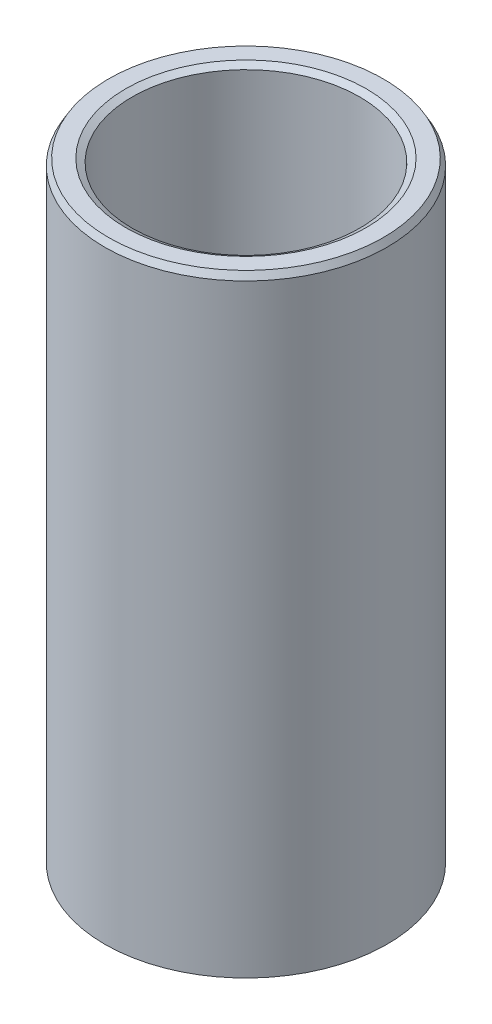
ISO-10303-21;
HEADER;
FILE_DESCRIPTION(('STEP AP214'),'2;1');
FILE_NAME('part.step','',(''),(''),'','','');
FILE_SCHEMA(('AUTOMOTIVE_DESIGN { 1 0 10303 214 1 1 1 1 }'));
ENDSEC;
DATA;
#1=APPLICATION_CONTEXT('core data for automotive mechanical design processes');
#2=APPLICATION_PROTOCOL_DEFINITION('international standard','automotive_design',2000,#1);
#3=PRODUCT_CONTEXT('',#1,'mechanical');
#4=PRODUCT('Part','Part','',(#3));
#5=PRODUCT_RELATED_PRODUCT_CATEGORY('part','',(#4));
#6=PRODUCT_DEFINITION_FORMATION('','',#4);
#7=PRODUCT_DEFINITION_CONTEXT('part definition',#1,'design');
#8=PRODUCT_DEFINITION('design','',#6,#7);
#9=PRODUCT_DEFINITION_SHAPE('','',#8);
#10=(LENGTH_UNIT() NAMED_UNIT(*) SI_UNIT(.MILLI.,.METRE.));
#11=(NAMED_UNIT(*) PLANE_ANGLE_UNIT() SI_UNIT($,.RADIAN.));
#12=(NAMED_UNIT(*) SI_UNIT($,.STERADIAN.) SOLID_ANGLE_UNIT());
#13=UNCERTAINTY_MEASURE_WITH_UNIT(LENGTH_MEASURE(1.E-05),#10,'distance_accuracy_value','');
#14=(GEOMETRIC_REPRESENTATION_CONTEXT(3) GLOBAL_UNCERTAINTY_ASSIGNED_CONTEXT((#13)) GLOBAL_UNIT_ASSIGNED_CONTEXT((#10,
#11,#12)) REPRESENTATION_CONTEXT('',''));
#15=CARTESIAN_POINT('',(0.,0.,0.));
#16=DIRECTION('',(0.,0.,1.));
#17=DIRECTION('',(1.,0.,0.));
#18=AXIS2_PLACEMENT_3D('',#15,#16,#17);
#19=CARTESIAN_POINT('',(0.,195.673046038324,0.));
#20=DIRECTION('',(0.,-1.,0.));
#21=DIRECTION('',(0.,0.,-1.));
#22=AXIS2_PLACEMENT_3D('',#19,#20,#21);
#23=CYLINDRICAL_SURFACE('',#22,45.);
#24=CARTESIAN_POINT('',(0.,1.20009938992954,0.));
#25=DIRECTION('',(0.,1.,0.));
#26=DIRECTION('',(0.,0.,1.));
#27=AXIS2_PLACEMENT_3D('',#24,#25,#26);
#28=CIRCLE('',#27,45.);
#29=CARTESIAN_POINT('',(0.,1.20009938992954,45.));
#30=VERTEX_POINT('',#29);
#31=EDGE_CURVE('E10',#30,#30,#28,.T.);
#32=ORIENTED_EDGE('',*,*,#31,.T.);
#33=EDGE_LOOP('',(#32));
#34=FACE_BOUND('',#33,.T.);
#35=CARTESIAN_POINT('',(0.,193.594412920833,0.));
#36=DIRECTION('',(0.,1.,0.));
#37=DIRECTION('',(0.,0.,1.));
#38=AXIS2_PLACEMENT_3D('',#35,#36,#37);
#39=CIRCLE('',#38,45.);
#40=CARTESIAN_POINT('',(0.,193.594412920833,45.));
#41=VERTEX_POINT('',#40);
#42=EDGE_CURVE('E50',#41,#41,#39,.F.);
#43=ORIENTED_EDGE('',*,*,#42,.T.);
#44=EDGE_LOOP('',(#43));
#45=FACE_BOUND('',#44,.T.);
#46=ADVANCED_FACE('F39',(#34,#45),#23,.T.);
#47=CARTESIAN_POINT('',(0.,195.673046038324,0.));
#48=DIRECTION('',(0.,1.,0.));
#49=DIRECTION('',(0.,0.,1.));
#50=AXIS2_PLACEMENT_3D('',#47,#48,#49);
#51=PLANE('',#50);
#52=CARTESIAN_POINT('',(0.,195.673046038324,0.));
#53=DIRECTION('',(0.,1.,0.));
#54=DIRECTION('',(0.,0.,1.));
#55=AXIS2_PLACEMENT_3D('',#52,#53,#54);
#56=CIRCLE('',#55,38.3434417289987);
#57=CARTESIAN_POINT('',(0.,195.673046038324,38.3434417289987));
#58=VERTEX_POINT('',#57);
#59=EDGE_CURVE('E58',#58,#58,#56,.F.);
#60=ORIENTED_EDGE('',*,*,#59,.T.);
#61=EDGE_LOOP('',(#60));
#62=FACE_BOUND('',#61,.T.);
#63=CARTESIAN_POINT('',(0.,195.673046038324,0.));
#64=DIRECTION('',(0.,1.,0.));
#65=DIRECTION('',(0.,0.,1.));
#66=AXIS2_PLACEMENT_3D('',#63,#64,#65);
#67=CIRCLE('',#66,43.7999006100704);
#68=CARTESIAN_POINT('',(0.,195.673046038324,43.7999006100704));
#69=VERTEX_POINT('',#68);
#70=EDGE_CURVE('E61',#69,#69,#67,.T.);
#71=ORIENTED_EDGE('',*,*,#70,.T.);
#72=EDGE_LOOP('',(#71));
#73=FACE_BOUND('',#72,.T.);
#74=ADVANCED_FACE('F88',(#62,#73),#51,.T.);
#75=CARTESIAN_POINT('',(0.,0.,0.));
#76=DIRECTION('',(0.,1.,0.));
#77=DIRECTION('',(0.,0.,1.));
#78=AXIS2_PLACEMENT_3D('',#75,#76,#77);
#79=PLANE('',#78);
#80=CARTESIAN_POINT('',(0.,0.,0.));
#81=DIRECTION('',(0.,1.,0.));
#82=DIRECTION('',(0.,0.,1.));
#83=AXIS2_PLACEMENT_3D('',#80,#81,#82);
#84=CIRCLE('',#83,37.4649080014379);
#85=CARTESIAN_POINT('',(0.,0.,37.4649080014379));
#86=VERTEX_POINT('',#85);
#87=EDGE_CURVE('E51',#86,#86,#84,.T.);
#88=ORIENTED_EDGE('',*,*,#87,.T.);
#89=EDGE_LOOP('',(#88));
#90=FACE_BOUND('',#89,.T.);
#91=CARTESIAN_POINT('',(0.,0.,0.));
#92=DIRECTION('',(0.,1.,0.));
#93=DIRECTION('',(0.,0.,1.));
#94=AXIS2_PLACEMENT_3D('',#91,#92,#93);
#95=CIRCLE('',#94,42.9213668825096);
#96=CARTESIAN_POINT('',(0.,0.,42.9213668825096));
#97=VERTEX_POINT('',#96);
#98=EDGE_CURVE('E54',#97,#97,#95,.F.);
#99=ORIENTED_EDGE('',*,*,#98,.T.);
#100=EDGE_LOOP('',(#99));
#101=FACE_BOUND('',#100,.T.);
#102=ADVANCED_FACE('F83',(#90,#101),#79,.F.);
#103=CARTESIAN_POINT('',(0.,195.673046038324,0.));
#104=DIRECTION('',(0.,-1.,0.));
#105=DIRECTION('',(0.,0.,-1.));
#106=AXIS2_PLACEMENT_3D('',#103,#104,#105);
#107=CYLINDRICAL_SURFACE('',#106,36.2648086115083);
#108=CARTESIAN_POINT('',(0.,194.472946648394,0.));
#109=DIRECTION('',(0.,1.,0.));
#110=DIRECTION('',(0.,0.,1.));
#111=AXIS2_PLACEMENT_3D('',#108,#109,#110);
#112=CIRCLE('',#111,36.2648086115083);
#113=CARTESIAN_POINT('',(0.,194.472946648394,36.2648086115083));
#114=VERTEX_POINT('',#113);
#115=EDGE_CURVE('E67',#114,#114,#112,.T.);
#116=ORIENTED_EDGE('',*,*,#115,.T.);
#117=EDGE_LOOP('',(#116));
#118=FACE_BOUND('',#117,.T.);
#119=CARTESIAN_POINT('',(0.,2.07863311749049,0.));
#120=DIRECTION('',(0.,1.,0.));
#121=DIRECTION('',(0.,0.,1.));
#122=AXIS2_PLACEMENT_3D('',#119,#120,#121);
#123=CIRCLE('',#122,36.2648086115083);
#124=CARTESIAN_POINT('',(0.,2.07863311749049,36.2648086115083));
#125=VERTEX_POINT('',#124);
#126=EDGE_CURVE('E69',#125,#125,#123,.F.);
#127=ORIENTED_EDGE('',*,*,#126,.T.);
#128=EDGE_LOOP('',(#127));
#129=FACE_BOUND('',#128,.T.);
#130=ADVANCED_FACE('F71',(#118,#129),#107,.F.);
#131=CARTESIAN_POINT('',(0.,194.472946648394,0.));
#132=DIRECTION('',(0.,1.,0.));
#133=DIRECTION('',(0.,0.,1.));
#134=AXIS2_PLACEMENT_3D('',#131,#132,#133);
#135=CONICAL_SURFACE('',#134,36.2648086115083,1.0471975511966);
#136=CARTESIAN_POINT('',(0.,195.673046038324,38.3434417289987));
#137=CARTESIAN_POINT('',(0.,195.660545003012,38.3217893006915));
#138=CARTESIAN_POINT('',(0.,195.6480439677,38.3001368723843));
#139=CARTESIAN_POINT('',(0.,195.623041897077,38.2568320157699));
#140=CARTESIAN_POINT('',(0.,195.610540861765,38.2351795874627));
#141=CARTESIAN_POINT('',(0.,195.585538791142,38.1918747308484));
#142=CARTESIAN_POINT('',(0.,195.57303775583,38.1702223025412));
#143=CARTESIAN_POINT('',(0.,195.548035685206,38.1269174459268));
#144=CARTESIAN_POINT('',(0.,195.535534649894,38.1052650176196));
#145=CARTESIAN_POINT('',(0.,195.510532579271,38.0619601610052));
#146=CARTESIAN_POINT('',(0.,195.498031543959,38.040307732698));
#147=CARTESIAN_POINT('',(0.,195.473029473336,37.9970028760836));
#148=CARTESIAN_POINT('',(0.,195.460528438024,37.9753504477764));
#149=CARTESIAN_POINT('',(0.,195.4355263674,37.9320455911621));
#150=CARTESIAN_POINT('',(0.,195.423025332089,37.9103931628549));
#151=CARTESIAN_POINT('',(0.,195.398023261465,37.8670883062405));
#152=CARTESIAN_POINT('',(0.,195.385522226153,37.8454358779333));
#153=CARTESIAN_POINT('',(0.,195.36052015553,37.8021310213189));
#154=CARTESIAN_POINT('',(0.,195.348019120218,37.7804785930117));
#155=CARTESIAN_POINT('',(0.,195.323017049594,37.7371737363973));
#156=CARTESIAN_POINT('',(0.,195.310516014283,37.7155213080901));
#157=CARTESIAN_POINT('',(0.,195.285513943659,37.6722164514757));
#158=CARTESIAN_POINT('',(0.,195.273012908347,37.6505640231686));
#159=CARTESIAN_POINT('',(0.,195.248010837724,37.6072591665542));
#160=CARTESIAN_POINT('',(0.,195.235509802412,37.585606738247));
#161=CARTESIAN_POINT('',(0.,195.210507731789,37.5423018816326));
#162=CARTESIAN_POINT('',(0.,195.198006696477,37.5206494533254));
#163=CARTESIAN_POINT('',(0.,195.173004625853,37.477344596711));
#164=CARTESIAN_POINT('',(0.,195.160503590541,37.4556921684038));
#165=CARTESIAN_POINT('',(0.,195.135501519918,37.4123873117894));
#166=CARTESIAN_POINT('',(0.,195.123000484606,37.3907348834822));
#167=CARTESIAN_POINT('',(0.,195.097998413983,37.3474300268679));
#168=CARTESIAN_POINT('',(0.,195.085497378671,37.3257775985607));
#169=CARTESIAN_POINT('',(0.,195.060495308047,37.2824727419463));
#170=CARTESIAN_POINT('',(0.,195.047994272736,37.2608203136391));
#171=CARTESIAN_POINT('',(0.,195.022992202112,37.2175154570247));
#172=CARTESIAN_POINT('',(0.,195.0104911668,37.1958630287175));
#173=CARTESIAN_POINT('',(0.,194.985489096177,37.1525581721031));
#174=CARTESIAN_POINT('',(0.,194.972988060865,37.1309057437959));
#175=CARTESIAN_POINT('',(0.,194.947985990241,37.0876008871816));
#176=CARTESIAN_POINT('',(0.,194.93548495493,37.0659484588744));
#177=CARTESIAN_POINT('',(0.,194.910482884306,37.02264360226));
#178=CARTESIAN_POINT('',(0.,194.897981848994,37.0009911739528));
#179=CARTESIAN_POINT('',(0.,194.872979778371,36.9576863173384));
#180=CARTESIAN_POINT('',(0.,194.860478743059,36.9360338890312));
#181=CARTESIAN_POINT('',(0.,194.835476672436,36.8927290324168));
#182=CARTESIAN_POINT('',(0.,194.822975637124,36.8710766041096));
#183=CARTESIAN_POINT('',(0.,194.7979735665,36.8277717474952));
#184=CARTESIAN_POINT('',(0.,194.785472531189,36.8061193191881));
#185=CARTESIAN_POINT('',(0.,194.760470460565,36.7628144625737));
#186=CARTESIAN_POINT('',(0.,194.747969425253,36.7411620342665));
#187=CARTESIAN_POINT('',(0.,194.72296735463,36.6978571776521));
#188=CARTESIAN_POINT('',(0.,194.710466319318,36.6762047493449));
#189=CARTESIAN_POINT('',(0.,194.685464248694,36.6328998927305));
#190=CARTESIAN_POINT('',(0.,194.672963213383,36.6112474644233));
#191=CARTESIAN_POINT('',(0.,194.647961142759,36.5679426078089));
#192=CARTESIAN_POINT('',(0.,194.635460107447,36.5462901795017));
#193=CARTESIAN_POINT('',(0.,194.610458036824,36.5029853228874));
#194=CARTESIAN_POINT('',(0.,194.597957001512,36.4813328945802));
#195=CARTESIAN_POINT('',(0.,194.572954930888,36.4380280379658));
#196=CARTESIAN_POINT('',(0.,194.560453895577,36.4163756096586));
#197=CARTESIAN_POINT('',(0.,194.535451824953,36.3730707530442));
#198=CARTESIAN_POINT('',(0.,194.522950789641,36.351418324737));
#199=CARTESIAN_POINT('',(0.,194.497948719018,36.3081134681226));
#200=CARTESIAN_POINT('',(0.,194.485447683706,36.2864610398155));
#201=CARTESIAN_POINT('',(0.,194.472946648394,36.2648086115083));
#202=B_SPLINE_CURVE_WITH_KNOTS('',3,(#136,#137,#138,#139,#140,#141,#142,#143,#144,#145,#146,
#147,#148,#149,#150,#151,#152,#153,#154,#155,#156,#157,#158,#159,#160,#161,#162,#163,#164,#165,
#166,#167,#168,#169,#170,#171,#172,#173,#174,#175,#176,#177,#178,#179,#180,#181,#182,#183,#184,
#185,#186,#187,#188,#189,#190,#191,#192,#193,#194,#195,#196,#197,#198,#199,#200,#201),
.UNSPECIFIED.,.F.,.F.,(4,2,2,2,2,2,2,2,2,2,2,2,2,2,2,2,2,2,2,2,2,2,2,2,2,2,2,2,2,2,2,2,4),(0.,
0.0750062118705847,0.150012423741189,0.22501863561178,0.300024847482385,0.375031059352975,
0.45003727122358,0.525043483094184,0.600049694964775,0.67505590683538,0.75006211870597,
0.825068330576575,0.90007454244718,0.97508075431777,1.05008696618837,1.12509317805897,
1.20009938992957,1.27510560180018,1.35011181367077,1.42511802554137,1.50012423741196,
1.57513044928257,1.65013666115317,1.72514287302376,1.80014908489437,1.87515529676496,
1.95016150863556,2.02516772050617,2.10017393237676,2.17518014424736,2.25018635611795,
2.32519256798855,2.40019877985914),.UNSPECIFIED.);
#203=EDGE_CURVE('BSEAM77',#58,#114,#202,.T.);
#204=ORIENTED_EDGE('',*,*,#59,.F.);
#205=ORIENTED_EDGE('',*,*,#115,.F.);
#206=ORIENTED_EDGE('',*,*,#203,.T.);
#207=ORIENTED_EDGE('',*,*,#203,.F.);
#208=EDGE_LOOP('',(#204,#206,#205,#207));
#209=FACE_BOUND('',#208,.T.);
#210=ADVANCED_FACE('F77',(#209),#135,.F.);
#211=CARTESIAN_POINT('',(0.,0.,0.));
#212=DIRECTION('',(0.,-1.,0.));
#213=DIRECTION('',(0.,0.,-1.));
#214=AXIS2_PLACEMENT_3D('',#211,#212,#213);
#215=CONICAL_SURFACE('',#214,37.4649080014379,0.52359877559829);
#216=ORIENTED_EDGE('',*,*,#126,.F.);
#217=EDGE_LOOP('',(#216));
#218=FACE_BOUND('',#217,.T.);
#219=ORIENTED_EDGE('',*,*,#87,.F.);
#220=EDGE_LOOP('',(#219));
#221=FACE_BOUND('',#220,.T.);
#222=ADVANCED_FACE('F73',(#218,#221),#215,.F.);
#223=CARTESIAN_POINT('',(0.,1.20009938992954,0.));
#224=DIRECTION('',(0.,1.,0.));
#225=DIRECTION('',(0.,0.,1.));
#226=AXIS2_PLACEMENT_3D('',#223,#224,#225);
#227=CONICAL_SURFACE('',#226,45.,1.0471975511966);
#228=ORIENTED_EDGE('',*,*,#98,.F.);
#229=EDGE_LOOP('',(#228));
#230=FACE_BOUND('',#229,.T.);
#231=ORIENTED_EDGE('',*,*,#31,.F.);
#232=EDGE_LOOP('',(#231));
#233=FACE_BOUND('',#232,.T.);
#234=ADVANCED_FACE('F76',(#230,#233),#227,.T.);
#235=CARTESIAN_POINT('',(0.,195.673046038324,0.));
#236=DIRECTION('',(0.,-1.,0.));
#237=DIRECTION('',(0.,0.,-1.));
#238=AXIS2_PLACEMENT_3D('',#235,#236,#237);
#239=CONICAL_SURFACE('',#238,43.7999006100704,0.523598775598289);
#240=ORIENTED_EDGE('',*,*,#42,.F.);
#241=EDGE_LOOP('',(#240));
#242=FACE_BOUND('',#241,.T.);
#243=ORIENTED_EDGE('',*,*,#70,.F.);
#244=EDGE_LOOP('',(#243));
#245=FACE_BOUND('',#244,.T.);
#246=ADVANCED_FACE('F45',(#242,#245),#239,.T.);
#247=CLOSED_SHELL('',(#46,#74,#102,#130,#210,#222,#234,#246));
#248=MANIFOLD_SOLID_BREP('B2',#247);
#249=ADVANCED_BREP_SHAPE_REPRESENTATION('',(#18,#248),#14);
#250=SHAPE_DEFINITION_REPRESENTATION(#9,#249);
ENDSEC;
END-ISO-10303-21;
